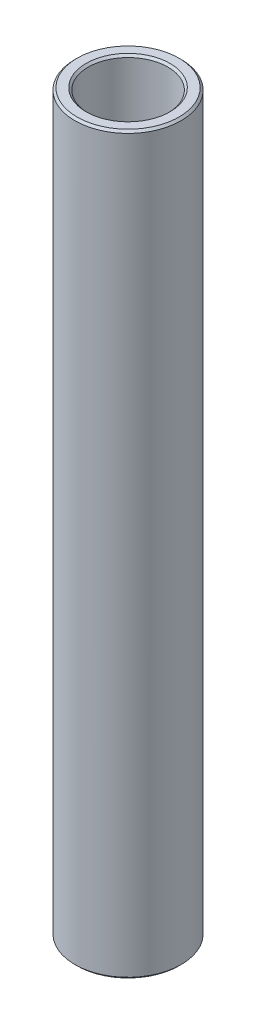
ISO-10303-21;
HEADER;
FILE_DESCRIPTION(('STEP AP214'),'2;1');
FILE_NAME('part.step','',(''),(''),'','','');
FILE_SCHEMA(('AUTOMOTIVE_DESIGN { 1 0 10303 214 1 1 1 1 }'));
ENDSEC;
DATA;
#1=APPLICATION_CONTEXT('core data for automotive mechanical design processes');
#2=APPLICATION_PROTOCOL_DEFINITION('international standard','automotive_design',2000,#1);
#3=PRODUCT_CONTEXT('',#1,'mechanical');
#4=PRODUCT('Part','Part','',(#3));
#5=PRODUCT_RELATED_PRODUCT_CATEGORY('part','',(#4));
#6=PRODUCT_DEFINITION_FORMATION('','',#4);
#7=PRODUCT_DEFINITION_CONTEXT('part definition',#1,'design');
#8=PRODUCT_DEFINITION('design','',#6,#7);
#9=PRODUCT_DEFINITION_SHAPE('','',#8);
#10=(LENGTH_UNIT() NAMED_UNIT(*) SI_UNIT(.MILLI.,.METRE.));
#11=(NAMED_UNIT(*) PLANE_ANGLE_UNIT() SI_UNIT($,.RADIAN.));
#12=(NAMED_UNIT(*) SI_UNIT($,.STERADIAN.) SOLID_ANGLE_UNIT());
#13=UNCERTAINTY_MEASURE_WITH_UNIT(LENGTH_MEASURE(1.E-05),#10,'distance_accuracy_value','');
#14=(GEOMETRIC_REPRESENTATION_CONTEXT(3) GLOBAL_UNCERTAINTY_ASSIGNED_CONTEXT((#13)) GLOBAL_UNIT_ASSIGNED_CONTEXT((#10,
#11,#12)) REPRESENTATION_CONTEXT('',''));
#15=CARTESIAN_POINT('',(0.,0.,0.));
#16=DIRECTION('',(0.,0.,1.));
#17=DIRECTION('',(1.,0.,0.));
#18=AXIS2_PLACEMENT_3D('',#15,#16,#17);
#19=CARTESIAN_POINT('',(6.35000000000028,131.762389929629,0.));
#20=DIRECTION('',(0.,-1.,0.));
#21=DIRECTION('',(1.,0.,0.));
#22=AXIS2_PLACEMENT_3D('',#19,#20,#21);
#23=PLANE('',#22);
#24=CARTESIAN_POINT('',(-7.07200651286719E-13,131.762389929628,0.));
#25=DIRECTION('',(0.,-1.,0.));
#26=DIRECTION('',(1.,0.,0.));
#27=AXIS2_PLACEMENT_3D('',#24,#25,#26);
#28=CIRCLE('',#27,5.01650000000075);
#29=CARTESIAN_POINT('',(5.01650000000005,131.762389929628,0.));
#30=VERTEX_POINT('',#29);
#31=EDGE_CURVE('E10',#30,#30,#28,.F.);
#32=ORIENTED_EDGE('',*,*,#31,.T.);
#33=EDGE_LOOP('',(#32));
#34=FACE_BOUND('',#33,.T.);
#35=CARTESIAN_POINT('',(-7.07200651286719E-13,131.762389929628,0.));
#36=DIRECTION('',(0.,-1.,0.));
#37=DIRECTION('',(1.,0.,0.));
#38=AXIS2_PLACEMENT_3D('',#35,#36,#37);
#39=CIRCLE('',#38,6.09600000000105);
#40=CARTESIAN_POINT('',(6.09600000000035,131.762389929629,0.));
#41=VERTEX_POINT('',#40);
#42=EDGE_CURVE('E38',#41,#41,#39,.T.);
#43=ORIENTED_EDGE('',*,*,#42,.T.);
#44=EDGE_LOOP('',(#43));
#45=FACE_BOUND('',#44,.T.);
#46=ADVANCED_FACE('F31',(#34,#45),#23,.T.);
#47=CARTESIAN_POINT('',(0.,122.237389929629,0.));
#48=DIRECTION('',(0.,-1.,0.));
#49=DIRECTION('',(1.,0.,0.));
#50=AXIS2_PLACEMENT_3D('',#47,#48,#49);
#51=CYLINDRICAL_SURFACE('',#50,4.76250000000398);
#52=CARTESIAN_POINT('',(-7.21203529074854E-12,219.373380994385,0.));
#53=DIRECTION('',(0.,1.,0.));
#54=DIRECTION('',(-1.,0.,0.));
#55=AXIS2_PLACEMENT_3D('',#52,#53,#54);
#56=CIRCLE('',#55,4.76250000000398);
#57=CARTESIAN_POINT('',(-4.76250000001119,219.373380994385,0.));
#58=VERTEX_POINT('',#57);
#59=EDGE_CURVE('E42',#58,#58,#56,.T.);
#60=ORIENTED_EDGE('',*,*,#59,.T.);
#61=EDGE_LOOP('',(#60));
#62=FACE_BOUND('',#61,.T.);
#63=CARTESIAN_POINT('',(-7.26059335320795E-13,132.016389929625,0.));
#64=DIRECTION('',(0.,-1.,0.));
#65=DIRECTION('',(1.,0.,0.));
#66=AXIS2_PLACEMENT_3D('',#63,#64,#65);
#67=CIRCLE('',#66,4.76250000000398);
#68=CARTESIAN_POINT('',(4.76250000000326,132.016389929625,0.));
#69=VERTEX_POINT('',#68);
#70=EDGE_CURVE('E46',#69,#69,#67,.T.);
#71=ORIENTED_EDGE('',*,*,#70,.T.);
#72=EDGE_LOOP('',(#71));
#73=FACE_BOUND('',#72,.T.);
#74=ADVANCED_FACE('F75',(#62,#73),#51,.F.);
#75=CARTESIAN_POINT('',(4.76250000000001,219.627380994389,0.));
#76=DIRECTION('',(0.,1.,0.));
#77=DIRECTION('',(-1.,0.,0.));
#78=AXIS2_PLACEMENT_3D('',#75,#76,#77);
#79=PLANE('',#78);
#80=CARTESIAN_POINT('',(-7.23089397478309E-12,219.627380994388,0.));
#81=DIRECTION('',(0.,1.,0.));
#82=DIRECTION('',(-1.,0.,0.));
#83=AXIS2_PLACEMENT_3D('',#80,#81,#82);
#84=CIRCLE('',#83,6.09600000000747);
#85=CARTESIAN_POINT('',(-6.0960000000147,219.627380994388,0.));
#86=VERTEX_POINT('',#85);
#87=EDGE_CURVE('E51',#86,#86,#84,.T.);
#88=ORIENTED_EDGE('',*,*,#87,.T.);
#89=EDGE_LOOP('',(#88));
#90=FACE_BOUND('',#89,.T.);
#91=CARTESIAN_POINT('',(-7.23089397478309E-12,219.627380994388,0.));
#92=DIRECTION('',(0.,1.,0.));
#93=DIRECTION('',(-1.,0.,0.));
#94=AXIS2_PLACEMENT_3D('',#91,#92,#93);
#95=CIRCLE('',#94,5.01650000000714);
#96=CARTESIAN_POINT('',(-5.01650000001437,219.627380994388,0.));
#97=VERTEX_POINT('',#96);
#98=EDGE_CURVE('E54',#97,#97,#95,.F.);
#99=ORIENTED_EDGE('',*,*,#98,.T.);
#100=EDGE_LOOP('',(#99));
#101=FACE_BOUND('',#100,.T.);
#102=ADVANCED_FACE('F80',(#90,#101),#79,.T.);
#103=CARTESIAN_POINT('',(0.,122.237389929629,0.));
#104=DIRECTION('',(0.,-1.,0.));
#105=DIRECTION('',(1.,0.,0.));
#106=AXIS2_PLACEMENT_3D('',#103,#104,#105);
#107=CYLINDRICAL_SURFACE('',#106,6.35000000000425);
#108=CARTESIAN_POINT('',(-7.21203529074901E-12,219.373380994392,0.));
#109=DIRECTION('',(0.,1.,0.));
#110=DIRECTION('',(-1.,0.,0.));
#111=AXIS2_PLACEMENT_3D('',#108,#109,#110);
#112=CIRCLE('',#111,6.35000000000425);
#113=CARTESIAN_POINT('',(-6.35000000001146,219.373380994391,0.));
#114=VERTEX_POINT('',#113);
#115=EDGE_CURVE('E57',#114,#114,#112,.F.);
#116=ORIENTED_EDGE('',*,*,#115,.T.);
#117=EDGE_LOOP('',(#116));
#118=FACE_BOUND('',#117,.T.);
#119=CARTESIAN_POINT('',(-7.26059335321268E-13,132.016389929631,0.));
#120=DIRECTION('',(0.,-1.,0.));
#121=DIRECTION('',(1.,0.,0.));
#122=AXIS2_PLACEMENT_3D('',#119,#120,#121);
#123=CIRCLE('',#122,6.35000000000425);
#124=CARTESIAN_POINT('',(6.35000000000352,132.016389929632,0.));
#125=VERTEX_POINT('',#124);
#126=EDGE_CURVE('E60',#125,#125,#123,.F.);
#127=ORIENTED_EDGE('',*,*,#126,.T.);
#128=EDGE_LOOP('',(#127));
#129=FACE_BOUND('',#128,.T.);
#130=ADVANCED_FACE('F64',(#118,#129),#107,.T.);
#131=CARTESIAN_POINT('',(-7.21203529074901E-12,219.373380994392,0.));
#132=DIRECTION('',(0.,-1.,0.));
#133=DIRECTION('',(1.,0.,0.));
#134=AXIS2_PLACEMENT_3D('',#131,#132,#133);
#135=CONICAL_SURFACE('',#134,6.35000000000425,0.785398163397435);
#136=ORIENTED_EDGE('',*,*,#87,.F.);
#137=EDGE_LOOP('',(#136));
#138=FACE_BOUND('',#137,.T.);
#139=ORIENTED_EDGE('',*,*,#115,.F.);
#140=EDGE_LOOP('',(#139));
#141=FACE_BOUND('',#140,.T.);
#142=ADVANCED_FACE('F85',(#138,#141),#135,.T.);
#143=CARTESIAN_POINT('',(-7.23089397478309E-12,219.627380994388,0.));
#144=DIRECTION('',(0.,1.,0.));
#145=DIRECTION('',(-1.,0.,0.));
#146=AXIS2_PLACEMENT_3D('',#143,#144,#145);
#147=CONICAL_SURFACE('',#146,5.01650000000716,0.785398163397418);
#148=ORIENTED_EDGE('',*,*,#59,.F.);
#149=EDGE_LOOP('',(#148));
#150=FACE_BOUND('',#149,.T.);
#151=ORIENTED_EDGE('',*,*,#98,.F.);
#152=EDGE_LOOP('',(#151));
#153=FACE_BOUND('',#152,.T.);
#154=ADVANCED_FACE('F72',(#150,#153),#147,.F.);
#155=CARTESIAN_POINT('',(-7.26059335320794E-13,132.016389929625,0.));
#156=DIRECTION('',(0.,-1.,0.));
#157=DIRECTION('',(1.,0.,0.));
#158=AXIS2_PLACEMENT_3D('',#155,#156,#157);
#159=CONICAL_SURFACE('',#158,4.76250000000398,0.785398163397424);
#160=ORIENTED_EDGE('',*,*,#31,.F.);
#161=EDGE_LOOP('',(#160));
#162=FACE_BOUND('',#161,.T.);
#163=ORIENTED_EDGE('',*,*,#70,.F.);
#164=EDGE_LOOP('',(#163));
#165=FACE_BOUND('',#164,.T.);
#166=ADVANCED_FACE('F68',(#162,#165),#159,.F.);
#167=CARTESIAN_POINT('',(-7.0720065128672E-13,131.762389929628,0.));
#168=DIRECTION('',(0.,1.,0.));
#169=DIRECTION('',(-1.,0.,0.));
#170=AXIS2_PLACEMENT_3D('',#167,#168,#169);
#171=CONICAL_SURFACE('',#170,6.09600000000105,0.785398163397503);
#172=ORIENTED_EDGE('',*,*,#126,.F.);
#173=EDGE_LOOP('',(#172));
#174=FACE_BOUND('',#173,.T.);
#175=ORIENTED_EDGE('',*,*,#42,.F.);
#176=EDGE_LOOP('',(#175));
#177=FACE_BOUND('',#176,.T.);
#178=ADVANCED_FACE('F33',(#174,#177),#171,.T.);
#179=CLOSED_SHELL('',(#46,#74,#102,#130,#142,#154,#166,#178));
#180=MANIFOLD_SOLID_BREP('B2',#179);
#181=ADVANCED_BREP_SHAPE_REPRESENTATION('',(#18,#180),#14);
#182=SHAPE_DEFINITION_REPRESENTATION(#9,#181);
ENDSEC;
END-ISO-10303-21;
